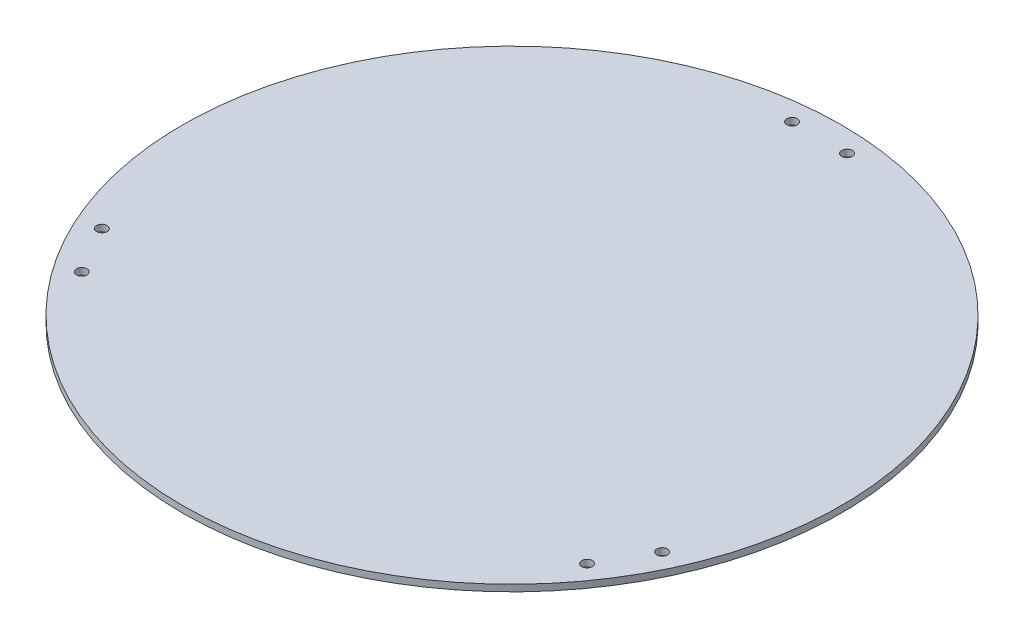
ISO-10303-21;
HEADER;
FILE_DESCRIPTION(('STEP AP214'),'2;1');
FILE_NAME('part.step','',(''),(''),'','','');
FILE_SCHEMA(('AUTOMOTIVE_DESIGN { 1 0 10303 214 1 1 1 1 }'));
ENDSEC;
DATA;
#1=APPLICATION_CONTEXT('core data for automotive mechanical design processes');
#2=APPLICATION_PROTOCOL_DEFINITION('international standard','automotive_design',2000,#1);
#3=PRODUCT_CONTEXT('',#1,'mechanical');
#4=PRODUCT('Part','Part','',(#3));
#5=PRODUCT_RELATED_PRODUCT_CATEGORY('part','',(#4));
#6=PRODUCT_DEFINITION_FORMATION('','',#4);
#7=PRODUCT_DEFINITION_CONTEXT('part definition',#1,'design');
#8=PRODUCT_DEFINITION('design','',#6,#7);
#9=PRODUCT_DEFINITION_SHAPE('','',#8);
#10=(LENGTH_UNIT() NAMED_UNIT(*) SI_UNIT(.MILLI.,.METRE.));
#11=(NAMED_UNIT(*) PLANE_ANGLE_UNIT() SI_UNIT($,.RADIAN.));
#12=(NAMED_UNIT(*) SI_UNIT($,.STERADIAN.) SOLID_ANGLE_UNIT());
#13=UNCERTAINTY_MEASURE_WITH_UNIT(LENGTH_MEASURE(1.E-05),#10,'distance_accuracy_value','');
#14=(GEOMETRIC_REPRESENTATION_CONTEXT(3) GLOBAL_UNCERTAINTY_ASSIGNED_CONTEXT((#13)) GLOBAL_UNIT_ASSIGNED_CONTEXT((#10,
#11,#12)) REPRESENTATION_CONTEXT('',''));
#15=CARTESIAN_POINT('',(0.,0.,0.));
#16=DIRECTION('',(0.,0.,1.));
#17=DIRECTION('',(1.,0.,0.));
#18=AXIS2_PLACEMENT_3D('',#15,#16,#17);
#19=CARTESIAN_POINT('',(0.,3.,-8.74300631892311E-13));
#20=DIRECTION('',(0.,1.,0.));
#21=DIRECTION('',(0.,0.,1.));
#22=AXIS2_PLACEMENT_3D('',#19,#20,#21);
#23=PLANE('',#22);
#24=CARTESIAN_POINT('',(-127.493556529821,3.,59.1746824526946));
#25=DIRECTION('',(0.,1.,0.));
#26=DIRECTION('',(0.,0.,1.));
#27=AXIS2_PLACEMENT_3D('',#24,#25,#26);
#28=CIRCLE('',#27,2.4);
#29=CARTESIAN_POINT('',(-127.493556529821,3.,61.5746824526946));
#30=VERTEX_POINT('',#29);
#31=EDGE_CURVE('E73',#30,#30,#28,.T.);
#32=ORIENTED_EDGE('',*,*,#31,.F.);
#33=EDGE_LOOP('',(#32));
#34=FACE_BOUND('',#33,.T.);
#35=CARTESIAN_POINT('',(114.993556529821,3.,80.8253175473055));
#36=DIRECTION('',(0.,1.,0.));
#37=DIRECTION('',(0.,0.,1.));
#38=AXIS2_PLACEMENT_3D('',#35,#36,#37);
#39=CIRCLE('',#38,2.4);
#40=CARTESIAN_POINT('',(114.993556529821,3.,83.2253175473055));
#41=VERTEX_POINT('',#40);
#42=EDGE_CURVE('E61',#41,#41,#39,.T.);
#43=ORIENTED_EDGE('',*,*,#42,.F.);
#44=EDGE_LOOP('',(#43));
#45=FACE_BOUND('',#44,.T.);
#46=CARTESIAN_POINT('',(12.5,3.,-140.));
#47=DIRECTION('',(0.,1.,0.));
#48=DIRECTION('',(0.,0.,1.));
#49=AXIS2_PLACEMENT_3D('',#46,#47,#48);
#50=CIRCLE('',#49,2.4);
#51=CARTESIAN_POINT('',(12.5,3.,-137.6));
#52=VERTEX_POINT('',#51);
#53=EDGE_CURVE('E50',#52,#52,#50,.T.);
#54=ORIENTED_EDGE('',*,*,#53,.F.);
#55=EDGE_LOOP('',(#54));
#56=FACE_BOUND('',#55,.T.);
#57=CARTESIAN_POINT('',(0.,3.,-8.74300631892311E-13));
#58=DIRECTION('',(0.,1.,0.));
#59=DIRECTION('',(0.,0.,1.));
#60=AXIS2_PLACEMENT_3D('',#57,#58,#59);
#61=CIRCLE('',#60,150.000000000006);
#62=CARTESIAN_POINT('',(0.,3.,150.000000000005));
#63=VERTEX_POINT('',#62);
#64=EDGE_CURVE('E10',#63,#63,#61,.T.);
#65=ORIENTED_EDGE('',*,*,#64,.T.);
#66=EDGE_LOOP('',(#65));
#67=FACE_BOUND('',#66,.T.);
#68=CARTESIAN_POINT('',(-12.5,3.,-140.));
#69=DIRECTION('',(0.,1.,0.));
#70=DIRECTION('',(0.,0.,1.));
#71=AXIS2_PLACEMENT_3D('',#68,#69,#70);
#72=CIRCLE('',#71,2.4);
#73=CARTESIAN_POINT('',(-12.5,3.,-137.6));
#74=VERTEX_POINT('',#73);
#75=EDGE_CURVE('E55',#74,#74,#72,.T.);
#76=ORIENTED_EDGE('',*,*,#75,.F.);
#77=EDGE_LOOP('',(#76));
#78=FACE_BOUND('',#77,.T.);
#79=CARTESIAN_POINT('',(127.493556529821,3.,59.1746824526945));
#80=DIRECTION('',(0.,1.,0.));
#81=DIRECTION('',(0.,0.,1.));
#82=AXIS2_PLACEMENT_3D('',#79,#80,#81);
#83=CIRCLE('',#82,2.4);
#84=CARTESIAN_POINT('',(127.493556529821,3.,61.5746824526945));
#85=VERTEX_POINT('',#84);
#86=EDGE_CURVE('E67',#85,#85,#83,.T.);
#87=ORIENTED_EDGE('',*,*,#86,.F.);
#88=EDGE_LOOP('',(#87));
#89=FACE_BOUND('',#88,.T.);
#90=CARTESIAN_POINT('',(-114.993556529821,3.,80.8253175473055));
#91=DIRECTION('',(0.,1.,0.));
#92=DIRECTION('',(0.,0.,1.));
#93=AXIS2_PLACEMENT_3D('',#90,#91,#92);
#94=CIRCLE('',#93,2.4);
#95=CARTESIAN_POINT('',(-114.993556529821,3.,83.2253175473055));
#96=VERTEX_POINT('',#95);
#97=EDGE_CURVE('E79',#96,#96,#94,.T.);
#98=ORIENTED_EDGE('',*,*,#97,.F.);
#99=EDGE_LOOP('',(#98));
#100=FACE_BOUND('',#99,.T.);
#101=ADVANCED_FACE('F39',(#34,#45,#56,#67,#78,#89,#100),#23,.T.);
#102=CARTESIAN_POINT('',(0.,0.,-8.74300631892311E-13));
#103=DIRECTION('',(0.,1.,0.));
#104=DIRECTION('',(0.,0.,1.));
#105=AXIS2_PLACEMENT_3D('',#102,#103,#104);
#106=PLANE('',#105);
#107=CARTESIAN_POINT('',(0.,0.,-8.74300631892311E-13));
#108=DIRECTION('',(0.,1.,0.));
#109=DIRECTION('',(0.,0.,1.));
#110=AXIS2_PLACEMENT_3D('',#107,#108,#109);
#111=CIRCLE('',#110,150.000000000006);
#112=CARTESIAN_POINT('',(0.,0.,150.000000000005));
#113=VERTEX_POINT('',#112);
#114=EDGE_CURVE('E43',#113,#113,#111,.T.);
#115=ORIENTED_EDGE('',*,*,#114,.F.);
#116=EDGE_LOOP('',(#115));
#117=FACE_BOUND('',#116,.T.);
#118=CARTESIAN_POINT('',(12.5,0.,-140.));
#119=DIRECTION('',(0.,1.,0.));
#120=DIRECTION('',(0.,0.,1.));
#121=AXIS2_PLACEMENT_3D('',#118,#119,#120);
#122=CIRCLE('',#121,2.4);
#123=CARTESIAN_POINT('',(12.5,0.,-137.6));
#124=VERTEX_POINT('',#123);
#125=EDGE_CURVE('E52',#124,#124,#122,.T.);
#126=ORIENTED_EDGE('',*,*,#125,.T.);
#127=EDGE_LOOP('',(#126));
#128=FACE_BOUND('',#127,.T.);
#129=CARTESIAN_POINT('',(-12.5,0.,-140.));
#130=DIRECTION('',(0.,1.,0.));
#131=DIRECTION('',(0.,0.,1.));
#132=AXIS2_PLACEMENT_3D('',#129,#130,#131);
#133=CIRCLE('',#132,2.4);
#134=CARTESIAN_POINT('',(-12.5,0.,-137.6));
#135=VERTEX_POINT('',#134);
#136=EDGE_CURVE('E58',#135,#135,#133,.T.);
#137=ORIENTED_EDGE('',*,*,#136,.T.);
#138=EDGE_LOOP('',(#137));
#139=FACE_BOUND('',#138,.T.);
#140=CARTESIAN_POINT('',(114.993556529821,0.,80.8253175473055));
#141=DIRECTION('',(0.,1.,0.));
#142=DIRECTION('',(0.,0.,1.));
#143=AXIS2_PLACEMENT_3D('',#140,#141,#142);
#144=CIRCLE('',#143,2.4);
#145=CARTESIAN_POINT('',(114.993556529821,0.,83.2253175473055));
#146=VERTEX_POINT('',#145);
#147=EDGE_CURVE('E64',#146,#146,#144,.T.);
#148=ORIENTED_EDGE('',*,*,#147,.T.);
#149=EDGE_LOOP('',(#148));
#150=FACE_BOUND('',#149,.T.);
#151=CARTESIAN_POINT('',(127.493556529821,0.,59.1746824526945));
#152=DIRECTION('',(0.,1.,0.));
#153=DIRECTION('',(0.,0.,1.));
#154=AXIS2_PLACEMENT_3D('',#151,#152,#153);
#155=CIRCLE('',#154,2.4);
#156=CARTESIAN_POINT('',(127.493556529821,0.,61.5746824526945));
#157=VERTEX_POINT('',#156);
#158=EDGE_CURVE('E70',#157,#157,#155,.T.);
#159=ORIENTED_EDGE('',*,*,#158,.T.);
#160=EDGE_LOOP('',(#159));
#161=FACE_BOUND('',#160,.T.);
#162=CARTESIAN_POINT('',(-127.493556529821,0.,59.1746824526946));
#163=DIRECTION('',(0.,1.,0.));
#164=DIRECTION('',(0.,0.,1.));
#165=AXIS2_PLACEMENT_3D('',#162,#163,#164);
#166=CIRCLE('',#165,2.4);
#167=CARTESIAN_POINT('',(-127.493556529821,0.,61.5746824526946));
#168=VERTEX_POINT('',#167);
#169=EDGE_CURVE('E76',#168,#168,#166,.T.);
#170=ORIENTED_EDGE('',*,*,#169,.T.);
#171=EDGE_LOOP('',(#170));
#172=FACE_BOUND('',#171,.T.);
#173=CARTESIAN_POINT('',(-114.993556529821,0.,80.8253175473055));
#174=DIRECTION('',(0.,1.,0.));
#175=DIRECTION('',(0.,0.,1.));
#176=AXIS2_PLACEMENT_3D('',#173,#174,#175);
#177=CIRCLE('',#176,2.4);
#178=CARTESIAN_POINT('',(-114.993556529821,0.,83.2253175473055));
#179=VERTEX_POINT('',#178);
#180=EDGE_CURVE('E82',#179,#179,#177,.T.);
#181=ORIENTED_EDGE('',*,*,#180,.T.);
#182=EDGE_LOOP('',(#181));
#183=FACE_BOUND('',#182,.T.);
#184=ADVANCED_FACE('F92',(#117,#128,#139,#150,#161,#172,#183),#106,.F.);
#185=CARTESIAN_POINT('',(0.,3.,-8.74300631892311E-13));
#186=DIRECTION('',(0.,-1.,0.));
#187=DIRECTION('',(0.,0.,-1.));
#188=AXIS2_PLACEMENT_3D('',#185,#186,#187);
#189=CYLINDRICAL_SURFACE('',#188,150.000000000006);
#190=ORIENTED_EDGE('',*,*,#64,.F.);
#191=EDGE_LOOP('',(#190));
#192=FACE_BOUND('',#191,.T.);
#193=ORIENTED_EDGE('',*,*,#114,.T.);
#194=EDGE_LOOP('',(#193));
#195=FACE_BOUND('',#194,.T.);
#196=ADVANCED_FACE('F41',(#192,#195),#189,.T.);
#197=CARTESIAN_POINT('',(12.5,3.,-140.));
#198=DIRECTION('',(0.,-1.,0.));
#199=DIRECTION('',(0.,0.,-1.));
#200=AXIS2_PLACEMENT_3D('',#197,#198,#199);
#201=CYLINDRICAL_SURFACE('',#200,2.4);
#202=ORIENTED_EDGE('',*,*,#53,.T.);
#203=EDGE_LOOP('',(#202));
#204=FACE_BOUND('',#203,.T.);
#205=ORIENTED_EDGE('',*,*,#125,.F.);
#206=EDGE_LOOP('',(#205));
#207=FACE_BOUND('',#206,.T.);
#208=ADVANCED_FACE('F102',(#204,#207),#201,.F.);
#209=CARTESIAN_POINT('',(-12.5,3.,-140.));
#210=DIRECTION('',(0.,-1.,0.));
#211=DIRECTION('',(0.,0.,-1.));
#212=AXIS2_PLACEMENT_3D('',#209,#210,#211);
#213=CYLINDRICAL_SURFACE('',#212,2.4);
#214=ORIENTED_EDGE('',*,*,#75,.T.);
#215=EDGE_LOOP('',(#214));
#216=FACE_BOUND('',#215,.T.);
#217=ORIENTED_EDGE('',*,*,#136,.F.);
#218=EDGE_LOOP('',(#217));
#219=FACE_BOUND('',#218,.T.);
#220=ADVANCED_FACE('F105',(#216,#219),#213,.F.);
#221=CARTESIAN_POINT('',(114.993556529821,3.,80.8253175473055));
#222=DIRECTION('',(0.,-1.,0.));
#223=DIRECTION('',(0.,0.,-1.));
#224=AXIS2_PLACEMENT_3D('',#221,#222,#223);
#225=CYLINDRICAL_SURFACE('',#224,2.4);
#226=ORIENTED_EDGE('',*,*,#42,.T.);
#227=EDGE_LOOP('',(#226));
#228=FACE_BOUND('',#227,.T.);
#229=ORIENTED_EDGE('',*,*,#147,.F.);
#230=EDGE_LOOP('',(#229));
#231=FACE_BOUND('',#230,.T.);
#232=ADVANCED_FACE('F109',(#228,#231),#225,.F.);
#233=CARTESIAN_POINT('',(127.493556529821,3.,59.1746824526945));
#234=DIRECTION('',(0.,-1.,0.));
#235=DIRECTION('',(0.,0.,-1.));
#236=AXIS2_PLACEMENT_3D('',#233,#234,#235);
#237=CYLINDRICAL_SURFACE('',#236,2.4);
#238=ORIENTED_EDGE('',*,*,#86,.T.);
#239=EDGE_LOOP('',(#238));
#240=FACE_BOUND('',#239,.T.);
#241=ORIENTED_EDGE('',*,*,#158,.F.);
#242=EDGE_LOOP('',(#241));
#243=FACE_BOUND('',#242,.T.);
#244=ADVANCED_FACE('F113',(#240,#243),#237,.F.);
#245=CARTESIAN_POINT('',(-127.493556529821,3.,59.1746824526946));
#246=DIRECTION('',(0.,-1.,0.));
#247=DIRECTION('',(0.,0.,-1.));
#248=AXIS2_PLACEMENT_3D('',#245,#246,#247);
#249=CYLINDRICAL_SURFACE('',#248,2.4);
#250=ORIENTED_EDGE('',*,*,#31,.T.);
#251=EDGE_LOOP('',(#250));
#252=FACE_BOUND('',#251,.T.);
#253=ORIENTED_EDGE('',*,*,#169,.F.);
#254=EDGE_LOOP('',(#253));
#255=FACE_BOUND('',#254,.T.);
#256=ADVANCED_FACE('F117',(#252,#255),#249,.F.);
#257=CARTESIAN_POINT('',(-114.993556529821,3.,80.8253175473055));
#258=DIRECTION('',(0.,-1.,0.));
#259=DIRECTION('',(0.,0.,-1.));
#260=AXIS2_PLACEMENT_3D('',#257,#258,#259);
#261=CYLINDRICAL_SURFACE('',#260,2.4);
#262=ORIENTED_EDGE('',*,*,#97,.T.);
#263=EDGE_LOOP('',(#262));
#264=FACE_BOUND('',#263,.T.);
#265=ORIENTED_EDGE('',*,*,#180,.F.);
#266=EDGE_LOOP('',(#265));
#267=FACE_BOUND('',#266,.T.);
#268=ADVANCED_FACE('F88',(#264,#267),#261,.F.);
#269=CLOSED_SHELL('',(#101,#184,#196,#208,#220,#232,#244,#256,#268));
#270=MANIFOLD_SOLID_BREP('B2',#269);
#271=ADVANCED_BREP_SHAPE_REPRESENTATION('',(#18,#270),#14);
#272=SHAPE_DEFINITION_REPRESENTATION(#9,#271);
ENDSEC;
END-ISO-10303-21;
